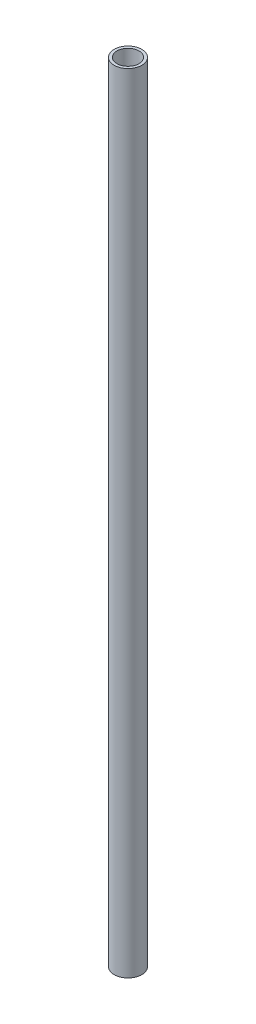
ISO-10303-21;
HEADER;
FILE_DESCRIPTION(('STEP AP214'),'2;1');
FILE_NAME('part.step','',(''),(''),'','','');
FILE_SCHEMA(('AUTOMOTIVE_DESIGN { 1 0 10303 214 1 1 1 1 }'));
ENDSEC;
DATA;
#1=APPLICATION_CONTEXT('core data for automotive mechanical design processes');
#2=APPLICATION_PROTOCOL_DEFINITION('international standard','automotive_design',2000,#1);
#3=PRODUCT_CONTEXT('',#1,'mechanical');
#4=PRODUCT('Part','Part','',(#3));
#5=PRODUCT_RELATED_PRODUCT_CATEGORY('part','',(#4));
#6=PRODUCT_DEFINITION_FORMATION('','',#4);
#7=PRODUCT_DEFINITION_CONTEXT('part definition',#1,'design');
#8=PRODUCT_DEFINITION('design','',#6,#7);
#9=PRODUCT_DEFINITION_SHAPE('','',#8);
#10=(LENGTH_UNIT() NAMED_UNIT(*) SI_UNIT(.MILLI.,.METRE.));
#11=(NAMED_UNIT(*) PLANE_ANGLE_UNIT() SI_UNIT($,.RADIAN.));
#12=(NAMED_UNIT(*) SI_UNIT($,.STERADIAN.) SOLID_ANGLE_UNIT());
#13=UNCERTAINTY_MEASURE_WITH_UNIT(LENGTH_MEASURE(1.E-05),#10,'distance_accuracy_value','');
#14=(GEOMETRIC_REPRESENTATION_CONTEXT(3) GLOBAL_UNCERTAINTY_ASSIGNED_CONTEXT((#13)) GLOBAL_UNIT_ASSIGNED_CONTEXT((#10,
#11,#12)) REPRESENTATION_CONTEXT('',''));
#15=CARTESIAN_POINT('',(0.,0.,0.));
#16=DIRECTION('',(0.,0.,1.));
#17=DIRECTION('',(1.,0.,0.));
#18=AXIS2_PLACEMENT_3D('',#15,#16,#17);
#19=CARTESIAN_POINT('',(0.,-444.,0.));
#20=DIRECTION('',(0.,1.,0.));
#21=DIRECTION('',(0.,0.,1.));
#22=AXIS2_PLACEMENT_3D('',#19,#20,#21);
#23=CYLINDRICAL_SURFACE('',#22,3.);
#24=CARTESIAN_POINT('',(0.,336.,0.));
#25=DIRECTION('',(0.,1.,0.));
#26=DIRECTION('',(0.,0.,1.));
#27=AXIS2_PLACEMENT_3D('',#24,#25,#26);
#28=CIRCLE('',#27,3.);
#29=CARTESIAN_POINT('',(0.,336.,3.));
#30=VERTEX_POINT('',#29);
#31=EDGE_CURVE('E51',#30,#30,#28,.T.);
#32=ORIENTED_EDGE('',*,*,#31,.T.);
#33=EDGE_LOOP('',(#32));
#34=FACE_BOUND('',#33,.T.);
#35=CARTESIAN_POINT('',(0.,-336.,0.));
#36=DIRECTION('',(0.,-1.,0.));
#37=DIRECTION('',(0.,0.,-1.));
#38=AXIS2_PLACEMENT_3D('',#35,#36,#37);
#39=CIRCLE('',#38,3.);
#40=CARTESIAN_POINT('',(0.,-336.,-3.));
#41=VERTEX_POINT('',#40);
#42=EDGE_CURVE('E37',#41,#41,#39,.F.);
#43=ORIENTED_EDGE('',*,*,#42,.F.);
#44=EDGE_LOOP('',(#43));
#45=FACE_BOUND('',#44,.T.);
#46=ADVANCED_FACE('F33',(#34,#45),#23,.F.);
#47=CARTESIAN_POINT('',(0.,356.,0.));
#48=DIRECTION('',(0.,-1.,0.));
#49=DIRECTION('',(0.,0.,-1.));
#50=AXIS2_PLACEMENT_3D('',#47,#48,#49);
#51=CYLINDRICAL_SURFACE('',#50,12.5);
#52=CARTESIAN_POINT('',(0.,356.,0.));
#53=DIRECTION('',(0.,1.,0.));
#54=DIRECTION('',(0.,0.,1.));
#55=AXIS2_PLACEMENT_3D('',#52,#53,#54);
#56=CIRCLE('',#55,12.5);
#57=CARTESIAN_POINT('',(0.,356.,12.5));
#58=VERTEX_POINT('',#57);
#59=EDGE_CURVE('E10',#58,#58,#56,.T.);
#60=ORIENTED_EDGE('',*,*,#59,.F.);
#61=EDGE_LOOP('',(#60));
#62=FACE_BOUND('',#61,.T.);
#63=CARTESIAN_POINT('',(0.,-356.,0.));
#64=DIRECTION('',(0.,1.,0.));
#65=DIRECTION('',(0.,0.,1.));
#66=AXIS2_PLACEMENT_3D('',#63,#64,#65);
#67=CIRCLE('',#66,12.5);
#68=CARTESIAN_POINT('',(0.,-356.,12.5));
#69=VERTEX_POINT('',#68);
#70=EDGE_CURVE('E41',#69,#69,#67,.T.);
#71=ORIENTED_EDGE('',*,*,#70,.T.);
#72=EDGE_LOOP('',(#71));
#73=FACE_BOUND('',#72,.T.);
#74=ADVANCED_FACE('F35',(#62,#73),#51,.T.);
#75=CARTESIAN_POINT('',(0.,356.,0.));
#76=DIRECTION('',(0.,1.,0.));
#77=DIRECTION('',(0.,0.,1.));
#78=AXIS2_PLACEMENT_3D('',#75,#76,#77);
#79=PLANE('',#78);
#80=CARTESIAN_POINT('',(0.,356.,0.));
#81=DIRECTION('',(0.,1.,0.));
#82=DIRECTION('',(0.,0.,1.));
#83=AXIS2_PLACEMENT_3D('',#80,#81,#82);
#84=CIRCLE('',#83,10.);
#85=CARTESIAN_POINT('',(0.,356.,10.));
#86=VERTEX_POINT('',#85);
#87=EDGE_CURVE('E49',#86,#86,#84,.T.);
#88=ORIENTED_EDGE('',*,*,#87,.F.);
#89=EDGE_LOOP('',(#88));
#90=FACE_BOUND('',#89,.T.);
#91=ORIENTED_EDGE('',*,*,#59,.T.);
#92=EDGE_LOOP('',(#91));
#93=FACE_BOUND('',#92,.T.);
#94=ADVANCED_FACE('F79',(#90,#93),#79,.T.);
#95=CARTESIAN_POINT('',(0.,-356.,0.));
#96=DIRECTION('',(0.,1.,0.));
#97=DIRECTION('',(0.,0.,1.));
#98=AXIS2_PLACEMENT_3D('',#95,#96,#97);
#99=PLANE('',#98);
#100=CARTESIAN_POINT('',(0.,-356.,0.));
#101=DIRECTION('',(0.,-1.,0.));
#102=DIRECTION('',(0.,0.,-1.));
#103=AXIS2_PLACEMENT_3D('',#100,#101,#102);
#104=CIRCLE('',#103,12.);
#105=CARTESIAN_POINT('',(0.,-356.,-12.));
#106=VERTEX_POINT('',#105);
#107=EDGE_CURVE('E61',#106,#106,#104,.T.);
#108=ORIENTED_EDGE('',*,*,#107,.F.);
#109=EDGE_LOOP('',(#108));
#110=FACE_BOUND('',#109,.T.);
#111=ORIENTED_EDGE('',*,*,#70,.F.);
#112=EDGE_LOOP('',(#111));
#113=FACE_BOUND('',#112,.T.);
#114=ADVANCED_FACE('F75',(#110,#113),#99,.F.);
#115=CARTESIAN_POINT('',(0.,336.,0.));
#116=DIRECTION('',(0.,1.,0.));
#117=DIRECTION('',(0.,0.,1.));
#118=AXIS2_PLACEMENT_3D('',#115,#116,#117);
#119=CYLINDRICAL_SURFACE('',#118,10.);
#120=CARTESIAN_POINT('',(0.,336.,0.));
#121=DIRECTION('',(0.,1.,0.));
#122=DIRECTION('',(0.,0.,1.));
#123=AXIS2_PLACEMENT_3D('',#120,#121,#122);
#124=CIRCLE('',#123,10.);
#125=CARTESIAN_POINT('',(0.,336.,10.));
#126=VERTEX_POINT('',#125);
#127=EDGE_CURVE('E46',#126,#126,#124,.T.);
#128=ORIENTED_EDGE('',*,*,#127,.F.);
#129=EDGE_LOOP('',(#128));
#130=FACE_BOUND('',#129,.T.);
#131=ORIENTED_EDGE('',*,*,#87,.T.);
#132=EDGE_LOOP('',(#131));
#133=FACE_BOUND('',#132,.T.);
#134=ADVANCED_FACE('F72',(#130,#133),#119,.F.);
#135=CARTESIAN_POINT('',(0.,336.,0.));
#136=DIRECTION('',(0.,1.,0.));
#137=DIRECTION('',(0.,0.,1.));
#138=AXIS2_PLACEMENT_3D('',#135,#136,#137);
#139=PLANE('',#138);
#140=ORIENTED_EDGE('',*,*,#31,.F.);
#141=EDGE_LOOP('',(#140));
#142=FACE_BOUND('',#141,.T.);
#143=ORIENTED_EDGE('',*,*,#127,.T.);
#144=EDGE_LOOP('',(#143));
#145=FACE_BOUND('',#144,.T.);
#146=ADVANCED_FACE('F70',(#142,#145),#139,.T.);
#147=CARTESIAN_POINT('',(0.,-336.,0.));
#148=DIRECTION('',(0.,-1.,0.));
#149=DIRECTION('',(0.,0.,-1.));
#150=AXIS2_PLACEMENT_3D('',#147,#148,#149);
#151=PLANE('',#150);
#152=CARTESIAN_POINT('',(0.,-336.,0.));
#153=DIRECTION('',(0.,-1.,0.));
#154=DIRECTION('',(0.,0.,-1.));
#155=AXIS2_PLACEMENT_3D('',#152,#153,#154);
#156=CIRCLE('',#155,12.);
#157=CARTESIAN_POINT('',(0.,-336.,-12.));
#158=VERTEX_POINT('',#157);
#159=EDGE_CURVE('E57',#158,#158,#156,.T.);
#160=ORIENTED_EDGE('',*,*,#159,.T.);
#161=EDGE_LOOP('',(#160));
#162=FACE_BOUND('',#161,.T.);
#163=ORIENTED_EDGE('',*,*,#42,.T.);
#164=EDGE_LOOP('',(#163));
#165=FACE_BOUND('',#164,.T.);
#166=ADVANCED_FACE('F98',(#162,#165),#151,.T.);
#167=CARTESIAN_POINT('',(0.,-336.,0.));
#168=DIRECTION('',(0.,-1.,0.));
#169=DIRECTION('',(0.,0.,-1.));
#170=AXIS2_PLACEMENT_3D('',#167,#168,#169);
#171=CYLINDRICAL_SURFACE('',#170,12.);
#172=ORIENTED_EDGE('',*,*,#159,.F.);
#173=EDGE_LOOP('',(#172));
#174=FACE_BOUND('',#173,.T.);
#175=ORIENTED_EDGE('',*,*,#107,.T.);
#176=EDGE_LOOP('',(#175));
#177=FACE_BOUND('',#176,.T.);
#178=ADVANCED_FACE('F95',(#174,#177),#171,.F.);
#179=CLOSED_SHELL('',(#46,#74,#94,#114,#134,#146,#166,#178));
#180=MANIFOLD_SOLID_BREP('B2',#179);
#181=ADVANCED_BREP_SHAPE_REPRESENTATION('',(#18,#180),#14);
#182=SHAPE_DEFINITION_REPRESENTATION(#9,#181);
ENDSEC;
END-ISO-10303-21;
